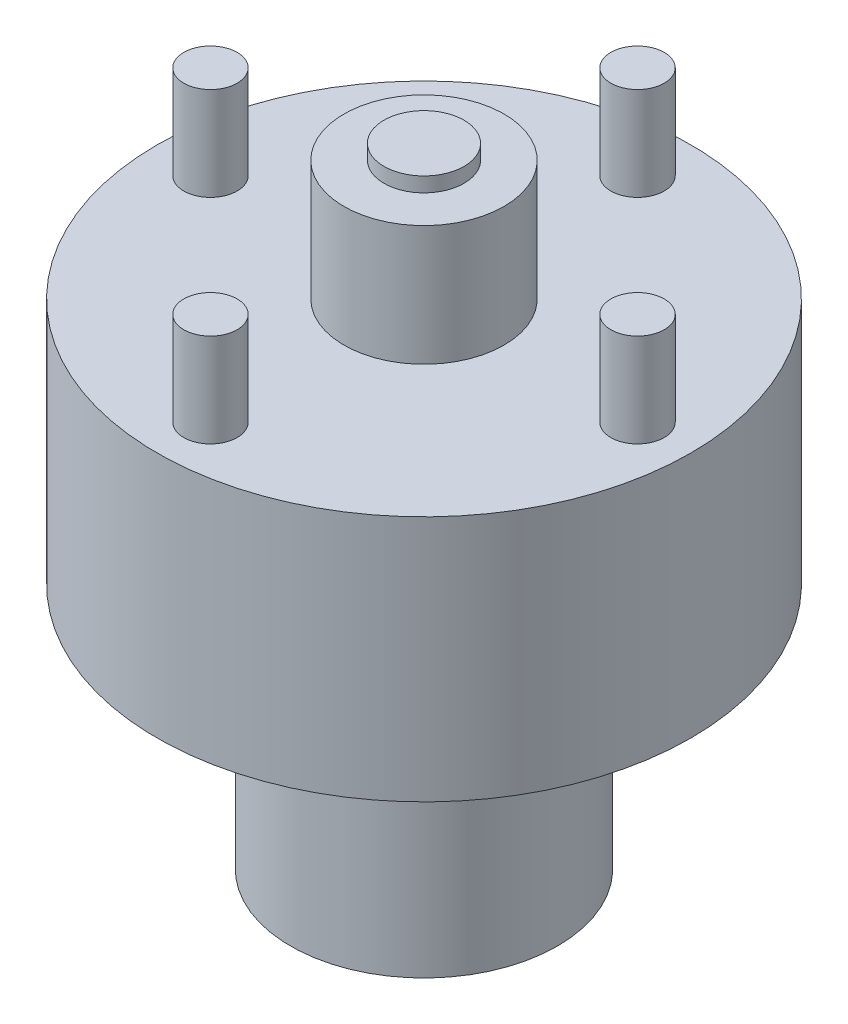
ISO-10303-21;
HEADER;
FILE_DESCRIPTION(('STEP AP214'),'2;1');
FILE_NAME('part.step','',(''),(''),'','','');
FILE_SCHEMA(('AUTOMOTIVE_DESIGN { 1 0 10303 214 1 1 1 1 }'));
ENDSEC;
DATA;
#1=APPLICATION_CONTEXT('core data for automotive mechanical design processes');
#2=APPLICATION_PROTOCOL_DEFINITION('international standard','automotive_design',2000,#1);
#3=PRODUCT_CONTEXT('',#1,'mechanical');
#4=PRODUCT('Part','Part','',(#3));
#5=PRODUCT_RELATED_PRODUCT_CATEGORY('part','',(#4));
#6=PRODUCT_DEFINITION_FORMATION('','',#4);
#7=PRODUCT_DEFINITION_CONTEXT('part definition',#1,'design');
#8=PRODUCT_DEFINITION('design','',#6,#7);
#9=PRODUCT_DEFINITION_SHAPE('','',#8);
#10=(LENGTH_UNIT() NAMED_UNIT(*) SI_UNIT(.MILLI.,.METRE.));
#11=(NAMED_UNIT(*) PLANE_ANGLE_UNIT() SI_UNIT($,.RADIAN.));
#12=(NAMED_UNIT(*) SI_UNIT($,.STERADIAN.) SOLID_ANGLE_UNIT());
#13=UNCERTAINTY_MEASURE_WITH_UNIT(LENGTH_MEASURE(1.E-05),#10,'distance_accuracy_value','');
#14=(GEOMETRIC_REPRESENTATION_CONTEXT(3) GLOBAL_UNCERTAINTY_ASSIGNED_CONTEXT((#13)) GLOBAL_UNIT_ASSIGNED_CONTEXT((#10,
#11,#12)) REPRESENTATION_CONTEXT('',''));
#15=CARTESIAN_POINT('',(0.,0.,0.));
#16=DIRECTION('',(0.,0.,1.));
#17=DIRECTION('',(1.,0.,0.));
#18=AXIS2_PLACEMENT_3D('',#15,#16,#17);
#19=CARTESIAN_POINT('',(0.,14.375,0.));
#20=DIRECTION('',(0.,1.,0.));
#21=DIRECTION('',(-1.,0.,0.));
#22=AXIS2_PLACEMENT_3D('',#19,#20,#21);
#23=PLANE('',#22);
#24=CARTESIAN_POINT('',(0.,14.375,0.));
#25=DIRECTION('',(0.,-1.,0.));
#26=DIRECTION('',(1.,0.,0.));
#27=AXIS2_PLACEMENT_3D('',#24,#25,#26);
#28=CIRCLE('',#27,1.5);
#29=CARTESIAN_POINT('',(1.5,14.375,0.));
#30=VERTEX_POINT('',#29);
#31=EDGE_CURVE('E10',#30,#30,#28,.T.);
#32=ORIENTED_EDGE('',*,*,#31,.F.);
#33=EDGE_LOOP('',(#32));
#34=FACE_BOUND('',#33,.T.);
#35=ADVANCED_FACE('F14',(#34),#23,.T.);
#36=CARTESIAN_POINT('',(0.,-4.325,0.));
#37=DIRECTION('',(0.,-1.,0.));
#38=DIRECTION('',(1.,0.,0.));
#39=AXIS2_PLACEMENT_3D('',#36,#37,#38);
#40=CYLINDRICAL_SURFACE('',#39,1.5);
#41=ORIENTED_EDGE('',*,*,#31,.T.);
#42=EDGE_LOOP('',(#41));
#43=FACE_BOUND('',#42,.T.);
#44=CARTESIAN_POINT('',(0.,13.825,0.));
#45=DIRECTION('',(0.,-1.,0.));
#46=DIRECTION('',(1.,0.,0.));
#47=AXIS2_PLACEMENT_3D('',#44,#45,#46);
#48=CIRCLE('',#47,1.5);
#49=CARTESIAN_POINT('',(1.5,13.825,0.));
#50=VERTEX_POINT('',#49);
#51=EDGE_CURVE('E25',#50,#50,#48,.T.);
#52=ORIENTED_EDGE('',*,*,#51,.F.);
#53=EDGE_LOOP('',(#52));
#54=FACE_BOUND('',#53,.T.);
#55=ADVANCED_FACE('F94',(#43,#54),#40,.T.);
#56=CARTESIAN_POINT('',(1.5,13.825,0.));
#57=DIRECTION('',(0.,1.,0.));
#58=DIRECTION('',(-1.,0.,0.));
#59=AXIS2_PLACEMENT_3D('',#56,#57,#58);
#60=PLANE('',#59);
#61=ORIENTED_EDGE('',*,*,#51,.T.);
#62=EDGE_LOOP('',(#61));
#63=FACE_BOUND('',#62,.T.);
#64=CARTESIAN_POINT('',(0.,13.825,0.));
#65=DIRECTION('',(0.,-1.,0.));
#66=DIRECTION('',(1.,0.,0.));
#67=AXIS2_PLACEMENT_3D('',#64,#65,#66);
#68=CIRCLE('',#67,3.);
#69=CARTESIAN_POINT('',(3.,13.825,0.));
#70=VERTEX_POINT('',#69);
#71=EDGE_CURVE('E29',#70,#70,#68,.T.);
#72=ORIENTED_EDGE('',*,*,#71,.F.);
#73=EDGE_LOOP('',(#72));
#74=FACE_BOUND('',#73,.T.);
#75=ADVANCED_FACE('F99',(#63,#74),#60,.T.);
#76=CARTESIAN_POINT('',(0.,-4.325,0.));
#77=DIRECTION('',(0.,-1.,0.));
#78=DIRECTION('',(1.,0.,0.));
#79=AXIS2_PLACEMENT_3D('',#76,#77,#78);
#80=CYLINDRICAL_SURFACE('',#79,3.);
#81=ORIENTED_EDGE('',*,*,#71,.T.);
#82=EDGE_LOOP('',(#81));
#83=FACE_BOUND('',#82,.T.);
#84=CARTESIAN_POINT('',(0.,9.325,0.));
#85=DIRECTION('',(0.,-1.,0.));
#86=DIRECTION('',(1.,0.,0.));
#87=AXIS2_PLACEMENT_3D('',#84,#85,#86);
#88=CIRCLE('',#87,3.);
#89=CARTESIAN_POINT('',(3.,9.325,0.));
#90=VERTEX_POINT('',#89);
#91=EDGE_CURVE('E34',#90,#90,#88,.T.);
#92=ORIENTED_EDGE('',*,*,#91,.F.);
#93=EDGE_LOOP('',(#92));
#94=FACE_BOUND('',#93,.T.);
#95=ADVANCED_FACE('F103',(#83,#94),#80,.T.);
#96=CARTESIAN_POINT('',(10.,9.325,0.));
#97=DIRECTION('',(0.,1.,0.));
#98=DIRECTION('',(-1.,0.,0.));
#99=AXIS2_PLACEMENT_3D('',#96,#97,#98);
#100=PLANE('',#99);
#101=CARTESIAN_POINT('',(8.,9.325,1.5144976769533E-13));
#102=DIRECTION('',(0.,1.,0.));
#103=DIRECTION('',(-1.,0.,0.));
#104=AXIS2_PLACEMENT_3D('',#101,#102,#103);
#105=CIRCLE('',#104,1.);
#106=CARTESIAN_POINT('',(7.,9.325,1.5144976769533E-13));
#107=VERTEX_POINT('',#106);
#108=EDGE_CURVE('E251',#107,#107,#105,.T.);
#109=ORIENTED_EDGE('',*,*,#108,.F.);
#110=EDGE_LOOP('',(#109));
#111=FACE_BOUND('',#110,.T.);
#112=CARTESIAN_POINT('',(1.21957625001815E-13,9.325,-8.));
#113=DIRECTION('',(0.,1.,0.));
#114=DIRECTION('',(-1.,0.,0.));
#115=AXIS2_PLACEMENT_3D('',#112,#113,#114);
#116=CIRCLE('',#115,1.);
#117=CARTESIAN_POINT('',(-0.999999999999878,9.325,-8.));
#118=VERTEX_POINT('',#117);
#119=EDGE_CURVE('E250',#118,#118,#116,.T.);
#120=ORIENTED_EDGE('',*,*,#119,.F.);
#121=EDGE_LOOP('',(#120));
#122=FACE_BOUND('',#121,.T.);
#123=CARTESIAN_POINT('',(-8.,9.325,0.));
#124=DIRECTION('',(0.,1.,0.));
#125=DIRECTION('',(-1.,0.,0.));
#126=AXIS2_PLACEMENT_3D('',#123,#124,#125);
#127=CIRCLE('',#126,1.);
#128=CARTESIAN_POINT('',(-9.,9.325,0.));
#129=VERTEX_POINT('',#128);
#130=EDGE_CURVE('E260',#129,#129,#127,.T.);
#131=ORIENTED_EDGE('',*,*,#130,.F.);
#132=EDGE_LOOP('',(#131));
#133=FACE_BOUND('',#132,.T.);
#134=CARTESIAN_POINT('',(0.,9.325,8.));
#135=DIRECTION('',(0.,1.,0.));
#136=DIRECTION('',(-1.,0.,0.));
#137=AXIS2_PLACEMENT_3D('',#134,#135,#136);
#138=CIRCLE('',#137,1.);
#139=CARTESIAN_POINT('',(-1.00000000000007,9.325,8.));
#140=VERTEX_POINT('',#139);
#141=EDGE_CURVE('E61',#140,#140,#138,.T.);
#142=ORIENTED_EDGE('',*,*,#141,.F.);
#143=EDGE_LOOP('',(#142));
#144=FACE_BOUND('',#143,.T.);
#145=ORIENTED_EDGE('',*,*,#91,.T.);
#146=EDGE_LOOP('',(#145));
#147=FACE_BOUND('',#146,.T.);
#148=CARTESIAN_POINT('',(0.,9.325,0.));
#149=DIRECTION('',(0.,-1.,0.));
#150=DIRECTION('',(1.,0.,0.));
#151=AXIS2_PLACEMENT_3D('',#148,#149,#150);
#152=CIRCLE('',#151,10.);
#153=CARTESIAN_POINT('',(10.,9.325,0.));
#154=VERTEX_POINT('',#153);
#155=EDGE_CURVE('E37',#154,#154,#152,.T.);
#156=ORIENTED_EDGE('',*,*,#155,.F.);
#157=EDGE_LOOP('',(#156));
#158=FACE_BOUND('',#157,.T.);
#159=ADVANCED_FACE('F110',(#111,#122,#133,#144,#147,#158),#100,.T.);
#160=CARTESIAN_POINT('',(0.,-4.325,0.));
#161=DIRECTION('',(0.,-1.,0.));
#162=DIRECTION('',(1.,0.,0.));
#163=AXIS2_PLACEMENT_3D('',#160,#161,#162);
#164=CYLINDRICAL_SURFACE('',#163,10.);
#165=ORIENTED_EDGE('',*,*,#155,.T.);
#166=EDGE_LOOP('',(#165));
#167=FACE_BOUND('',#166,.T.);
#168=CARTESIAN_POINT('',(0.,0.0749999999999987,0.));
#169=DIRECTION('',(0.,-1.,0.));
#170=DIRECTION('',(1.,0.,0.));
#171=AXIS2_PLACEMENT_3D('',#168,#169,#170);
#172=CIRCLE('',#171,10.);
#173=CARTESIAN_POINT('',(10.,0.0750000000000004,0.));
#174=VERTEX_POINT('',#173);
#175=EDGE_CURVE('E40',#174,#174,#172,.T.);
#176=ORIENTED_EDGE('',*,*,#175,.F.);
#177=EDGE_LOOP('',(#176));
#178=FACE_BOUND('',#177,.T.);
#179=ADVANCED_FACE('F114',(#167,#178),#164,.T.);
#180=CARTESIAN_POINT('',(5.,0.075,0.));
#181=DIRECTION('',(0.,-1.,0.));
#182=DIRECTION('',(1.,0.,0.));
#183=AXIS2_PLACEMENT_3D('',#180,#181,#182);
#184=PLANE('',#183);
#185=ORIENTED_EDGE('',*,*,#175,.T.);
#186=EDGE_LOOP('',(#185));
#187=FACE_BOUND('',#186,.T.);
#188=CARTESIAN_POINT('',(0.,0.075,0.));
#189=DIRECTION('',(0.,-1.,0.));
#190=DIRECTION('',(1.,0.,0.));
#191=AXIS2_PLACEMENT_3D('',#188,#189,#190);
#192=CIRCLE('',#191,5.);
#193=CARTESIAN_POINT('',(5.,0.0750000000000008,0.));
#194=VERTEX_POINT('',#193);
#195=EDGE_CURVE('E43',#194,#194,#192,.T.);
#196=ORIENTED_EDGE('',*,*,#195,.F.);
#197=EDGE_LOOP('',(#196));
#198=FACE_BOUND('',#197,.T.);
#199=ADVANCED_FACE('F90',(#187,#198),#184,.T.);
#200=CARTESIAN_POINT('',(0.,-4.325,0.));
#201=DIRECTION('',(0.,-1.,0.));
#202=DIRECTION('',(1.,0.,0.));
#203=AXIS2_PLACEMENT_3D('',#200,#201,#202);
#204=CYLINDRICAL_SURFACE('',#203,5.);
#205=CARTESIAN_POINT('',(-4.89897948556636,-6.75,-1.));
#206=CARTESIAN_POINT('',(-4.89898059043933,-6.80556437548198,-0.999997945876045));
#207=CARTESIAN_POINT('',(-4.89993508346913,-6.86115462330649,-0.995353171723656));
#208=CARTESIAN_POINT('',(-4.90364431385263,-6.97076250511841,-0.976912283588335));
#209=CARTESIAN_POINT('',(-4.90640049166332,-7.02477884463107,-0.963108847071181));
#210=CARTESIAN_POINT('',(-4.91338873700355,-7.12963730336293,-0.926795782617738));
#211=CARTESIAN_POINT('',(-4.91761933615312,-7.18048252153493,-0.904294814152084));
#212=CARTESIAN_POINT('',(-4.92707799486421,-7.27767484469461,-0.851249107671044));
#213=CARTESIAN_POINT('',(-4.93230599875014,-7.32402220053727,-0.820704818601296));
#214=CARTESIAN_POINT('',(-4.9432529969268,-7.4115610038545,-0.75197907565329));
#215=CARTESIAN_POINT('',(-4.94897737836825,-7.45267958788414,-0.713705655913281));
#216=CARTESIAN_POINT('',(-4.9602247230302,-7.52795753357881,-0.630806789021351));
#217=CARTESIAN_POINT('',(-4.96574767210945,-7.56211640741714,-0.586180896977995));
#218=CARTESIAN_POINT('',(-4.97602796417447,-7.6227880176285,-0.491361355924245));
#219=CARTESIAN_POINT('',(-4.9807782144152,-7.64923151381665,-0.441122567672208));
#220=CARTESIAN_POINT('',(-4.98891736883662,-7.69327493704813,-0.336804150387275));
#221=CARTESIAN_POINT('',(-4.99230640044128,-7.71087569190099,-0.282724881420554));
#222=CARTESIAN_POINT('',(-4.99730320688411,-7.73650719361963,-0.173016773278494));
#223=CARTESIAN_POINT('',(-4.99893386288125,-7.74466097757101,-0.117417739214814));
#224=CARTESIAN_POINT('',(-5.00030921183606,-7.75155095183831,-0.00561856843753665));
#225=CARTESIAN_POINT('',(-5.00005408652759,-7.75028804964582,0.0505815098318431));
#226=CARTESIAN_POINT('',(-4.99770434868515,-7.73847381978444,0.161142000743589));
#227=CARTESIAN_POINT('',(-4.99563598365838,-7.72805502283215,0.21551721429847));
#228=CARTESIAN_POINT('',(-4.98992177159409,-7.69843496754111,0.321731626580302));
#229=CARTESIAN_POINT('',(-4.98627586144039,-7.67923335780813,0.37357072374713));
#230=CARTESIAN_POINT('',(-4.97777296019959,-7.63246995985273,0.473619463200887));
#231=CARTESIAN_POINT('',(-4.97290848175224,-7.60485624889511,0.521804174133899));
#232=CARTESIAN_POINT('',(-4.96250469473785,-7.5420909227634,0.612905045859755));
#233=CARTESIAN_POINT('',(-4.95696530855222,-7.50693844022948,0.655820599525));
#234=CARTESIAN_POINT('',(-4.9457096436446,-7.42936637789153,0.735951431053457));
#235=CARTESIAN_POINT('',(-4.93999196457516,-7.38683081327041,0.773054316573631));
#236=CARTESIAN_POINT('',(-4.92911571598761,-7.29608355754925,0.839618493176807));
#237=CARTESIAN_POINT('',(-4.92395715704548,-7.2478717591168,0.869079639727751));
#238=CARTESIAN_POINT('',(-4.91478047472924,-7.1469791681782,0.919562814801881));
#239=CARTESIAN_POINT('',(-4.91076481563549,-7.09428903236034,0.940566647777709));
#240=CARTESIAN_POINT('',(-4.90436476321273,-6.98602867627601,0.973390341627581));
#241=CARTESIAN_POINT('',(-4.90198015728428,-6.93045883238092,0.985211399456641));
#242=CARTESIAN_POINT('',(-4.89915479267828,-6.81903514200096,0.999166006036051));
#243=CARTESIAN_POINT('',(-4.89868147057154,-6.76320242568966,1.00146185889791));
#244=CARTESIAN_POINT('',(-4.89964485688854,-6.65195177680032,0.996737628310738));
#245=CARTESIAN_POINT('',(-4.90108145700388,-6.59653382088114,0.989718073122442));
#246=CARTESIAN_POINT('',(-4.90567232494915,-6.48823135970776,0.966702208074156));
#247=CARTESIAN_POINT('',(-4.90880999014497,-6.43532765696424,0.950792620839297));
#248=CARTESIAN_POINT('',(-4.91643489351665,-6.33293672097126,0.910541035308517));
#249=CARTESIAN_POINT('',(-4.92092224286269,-6.28344976956428,0.886198342373176));
#250=CARTESIAN_POINT('',(-4.93081405962039,-6.18858689004984,0.829404142215597));
#251=CARTESIAN_POINT('',(-4.93622971864903,-6.14327295369917,0.796851077982752));
#252=CARTESIAN_POINT('',(-4.94733723826636,-6.05869168799908,0.724695572212711));
#253=CARTESIAN_POINT('',(-4.95302912723818,-6.01942498175074,0.685092405144536));
#254=CARTESIAN_POINT('',(-4.96415345869215,-5.94743744081442,0.59923227349789));
#255=CARTESIAN_POINT('',(-4.96958057708684,-5.91482634535,0.55288249892963));
#256=CARTESIAN_POINT('',(-4.9794712762862,-5.85785411850042,0.455267896634755));
#257=CARTESIAN_POINT('',(-4.98393489755211,-5.83349264065522,0.404003275433506));
#258=CARTESIAN_POINT('',(-4.99137294061067,-5.79387112825337,0.298302680824011));
#259=CARTESIAN_POINT('',(-4.99435579142604,-5.77855948177375,0.243886673478076));
#260=CARTESIAN_POINT('',(-4.9985323593766,-5.75730875233615,0.13318945467991));
#261=CARTESIAN_POINT('',(-4.99972629199843,-5.75136854052431,0.0769084687112125));
#262=CARTESIAN_POINT('',(-5.00018540454121,-5.74907301903711,-0.0348728939036245));
#263=CARTESIAN_POINT('',(-4.99948378549351,-5.75255271954379,-0.0903698121415032));
#264=CARTESIAN_POINT('',(-4.99630043560318,-5.76863395054781,-0.199971031315642));
#265=CARTESIAN_POINT('',(-4.99381872714351,-5.78123536634807,-0.254075349753692));
#266=CARTESIAN_POINT('',(-4.98735498365,-5.81512899209164,-0.359252749745098));
#267=CARTESIAN_POINT('',(-4.98337637247912,-5.83640137813118,-0.410332443240283));
#268=CARTESIAN_POINT('',(-4.97434722123382,-5.8870122413309,-0.508221220185954));
#269=CARTESIAN_POINT('',(-4.96929659645878,-5.91635135590372,-0.555029965767412));
#270=CARTESIAN_POINT('',(-4.95857599157868,-5.98281938706208,-0.643863890106359));
#271=CARTESIAN_POINT('',(-4.95289733422142,-6.02006633638677,-0.685799716116506));
#272=CARTESIAN_POINT('',(-4.94161222903622,-6.10105024009578,-0.762882617756848));
#273=CARTESIAN_POINT('',(-4.93600579862875,-6.14478872946874,-0.798028083202714));
#274=CARTESIAN_POINT('',(-4.92543342749964,-6.23807931670018,-0.860892219455201));
#275=CARTESIAN_POINT('',(-4.92047503631328,-6.28768896116037,-0.888526814639769));
#276=CARTESIAN_POINT('',(-4.91185237184445,-6.3909327732997,-0.93502404928781));
#277=CARTESIAN_POINT('',(-4.90818692536957,-6.44456323869792,-0.953894645979291));
#278=CARTESIAN_POINT('',(-4.90329681128922,-6.54026245543657,-0.978669139854273));
#279=CARTESIAN_POINT('',(-4.90168784915661,-6.58178541951146,-0.986653898522986));
#280=CARTESIAN_POINT('',(-4.8995287845803,-6.66553395455364,-0.99732001796041));
#281=CARTESIAN_POINT('',(-4.89897864563277,-6.70775950124817,-1.00000156156205));
#282=CARTESIAN_POINT('',(-4.89897948556636,-6.75,-1.));
#283=B_SPLINE_CURVE_WITH_KNOTS('',3,(#205,#206,#207,#208,#209,#210,#211,#212,#213,#214,#215,
#216,#217,#218,#219,#220,#221,#222,#223,#224,#225,#226,#227,#228,#229,#230,#231,#232,#233,#234,
#235,#236,#237,#238,#239,#240,#241,#242,#243,#244,#245,#246,#247,#248,#249,#250,#251,#252,#253,
#254,#255,#256,#257,#258,#259,#260,#261,#262,#263,#264,#265,#266,#267,#268,#269,#270,#271,#272,
#273,#274,#275,#276,#277,#278,#279,#280,#281,#282),.UNSPECIFIED.,.T.,.F.,(4,2,2,2,2,2,2,2,2,2,2,
2,2,2,2,2,2,2,2,2,2,2,2,2,2,2,2,2,2,2,2,2,2,2,2,2,2,2,4),(0.,0.166538463856524,
0.333210239259265,0.499716497915551,0.666213464834828,0.834822525459333,1.00344340032919,
1.17353400434947,1.34360868244057,1.51144248880577,1.67926012113745,1.84468789631034,
2.01012229071247,2.176599242198,2.34309535767563,2.5124934675998,2.68189478120217,
2.85165863170273,3.02140035013521,3.1882375780209,3.35506534525918,3.52029341780816,
3.68553510351896,3.85293059772018,4.02034332867706,4.19032601730947,4.36030156627602,
4.52929813576147,4.69827434689125,4.86431017412183,5.03034391364254,5.19600017072949,
5.36166952132181,5.53001152023094,5.69839338887278,5.86858898576538,6.0386297508643,
6.16523803634393,6.29184195681711),.UNSPECIFIED.);
#284=CARTESIAN_POINT('',(-4.89897948556636,-6.75,-1.));
#285=VERTEX_POINT('',#284);
#286=EDGE_CURVE('E55',#285,#285,#283,.T.);
#287=ORIENTED_EDGE('',*,*,#286,.F.);
#288=EDGE_LOOP('',(#287));
#289=FACE_BOUND('',#288,.T.);
#290=ORIENTED_EDGE('',*,*,#195,.T.);
#291=EDGE_LOOP('',(#290));
#292=FACE_BOUND('',#291,.T.);
#293=CARTESIAN_POINT('',(0.,-9.175,0.));
#294=DIRECTION('',(0.,-1.,0.));
#295=DIRECTION('',(1.,0.,0.));
#296=AXIS2_PLACEMENT_3D('',#293,#294,#295);
#297=CIRCLE('',#296,5.);
#298=CARTESIAN_POINT('',(5.,-9.175,0.));
#299=VERTEX_POINT('',#298);
#300=EDGE_CURVE('E46',#299,#299,#297,.T.);
#301=ORIENTED_EDGE('',*,*,#300,.F.);
#302=EDGE_LOOP('',(#301));
#303=FACE_BOUND('',#302,.T.);
#304=ADVANCED_FACE('F63',(#289,#292,#303),#204,.T.);
#305=CARTESIAN_POINT('',(2.85,-9.175,0.));
#306=DIRECTION('',(0.,-1.,0.));
#307=DIRECTION('',(1.,0.,0.));
#308=AXIS2_PLACEMENT_3D('',#305,#306,#307);
#309=PLANE('',#308);
#310=ORIENTED_EDGE('',*,*,#300,.T.);
#311=EDGE_LOOP('',(#310));
#312=FACE_BOUND('',#311,.T.);
#313=CARTESIAN_POINT('',(0.,-9.175,0.));
#314=DIRECTION('',(0.,-1.,0.));
#315=DIRECTION('',(1.,0.,0.));
#316=AXIS2_PLACEMENT_3D('',#313,#314,#315);
#317=CIRCLE('',#316,2.85);
#318=CARTESIAN_POINT('',(2.85,-9.175,0.));
#319=VERTEX_POINT('',#318);
#320=EDGE_CURVE('E49',#319,#319,#317,.T.);
#321=ORIENTED_EDGE('',*,*,#320,.F.);
#322=EDGE_LOOP('',(#321));
#323=FACE_BOUND('',#322,.T.);
#324=ADVANCED_FACE('F82',(#312,#323),#309,.T.);
#325=CARTESIAN_POINT('',(0.,-4.325,0.));
#326=DIRECTION('',(0.,-1.,0.));
#327=DIRECTION('',(1.,0.,0.));
#328=AXIS2_PLACEMENT_3D('',#325,#326,#327);
#329=CYLINDRICAL_SURFACE('',#328,2.85);
#330=CARTESIAN_POINT('',(-2.66880122901651,-6.75,-1.));
#331=CARTESIAN_POINT('',(-2.6688004561792,-6.6957195715336,-1.0000009088373));
#332=CARTESIAN_POINT('',(-2.67047529533561,-6.64144547181646,-0.995565595803335));
#333=CARTESIAN_POINT('',(-2.6769540281088,-6.53451694904152,-0.978009750469148));
#334=CARTESIAN_POINT('',(-2.68175816860933,-6.48186265412019,-0.964888532900042));
#335=CARTESIAN_POINT('',(-2.69388577441423,-6.37974264644938,-0.930488003285745));
#336=CARTESIAN_POINT('',(-2.70120386046258,-6.3302703910639,-0.909226099368961));
#337=CARTESIAN_POINT('',(-2.71752663239187,-6.23557750375952,-0.859208192677543));
#338=CARTESIAN_POINT('',(-2.72653174981666,-6.19035796414372,-0.830450271677981));
#339=CARTESIAN_POINT('',(-2.74565220206296,-6.10349109822925,-0.764919380662244));
#340=CARTESIAN_POINT('',(-2.75579731605631,-6.06205499571135,-0.727875033606545));
#341=CARTESIAN_POINT('',(-2.77580433788903,-5.98583727451353,-0.647400626530004));
#342=CARTESIAN_POINT('',(-2.78566619422497,-5.95105685957762,-0.603969413891318));
#343=CARTESIAN_POINT('',(-2.80434404816319,-5.88815556112437,-0.510385631744187));
#344=CARTESIAN_POINT('',(-2.81312099064914,-5.86025936669437,-0.460073552891832));
#345=CARTESIAN_POINT('',(-2.82828636345265,-5.81341182048635,-0.355109291057522));
#346=CARTESIAN_POINT('',(-2.83467551181298,-5.79445777922845,-0.300458418814162));
#347=CARTESIAN_POINT('',(-2.84413430705331,-5.76675879210415,-0.190585056556345));
#348=CARTESIAN_POINT('',(-2.8473215150007,-5.75765127156761,-0.135464284268941));
#349=CARTESIAN_POINT('',(-2.85043649550697,-5.74874737773224,-0.0243908239584998));
#350=CARTESIAN_POINT('',(-2.85036519708511,-5.74894835052763,0.0315616224015104));
#351=CARTESIAN_POINT('',(-2.84704888494739,-5.75843341298816,0.140130655832481));
#352=CARTESIAN_POINT('',(-2.84394173969892,-5.76732293135015,0.192786631831926));
#353=CARTESIAN_POINT('',(-2.83507910339868,-5.79327568266814,0.295805492712652));
#354=CARTESIAN_POINT('',(-2.82932342862927,-5.81033948264387,0.346168218254199));
#355=CARTESIAN_POINT('',(-2.81564310780338,-5.8523670644065,0.443992098179209));
#356=CARTESIAN_POINT('',(-2.80768960652686,-5.87743668848086,0.491403578107379));
#357=CARTESIAN_POINT('',(-2.79043223607277,-5.93467464112633,0.581457940211361));
#358=CARTESIAN_POINT('',(-2.7811279647844,-5.96684508503011,0.624099395682192));
#359=CARTESIAN_POINT('',(-2.7615721871171,-6.03932497584303,0.705742571770237));
#360=CARTESIAN_POINT('',(-2.7512965796386,-6.07996972656193,0.744441295827144));
#361=CARTESIAN_POINT('',(-2.73135409710691,-6.16724998858519,0.814578126149172));
#362=CARTESIAN_POINT('',(-2.72168733842612,-6.21388664000509,0.846014847435269));
#363=CARTESIAN_POINT('',(-2.70391670225723,-6.31288176839945,0.901217580263694));
#364=CARTESIAN_POINT('',(-2.69584274091759,-6.36532524289232,0.924841548429458));
#365=CARTESIAN_POINT('',(-2.68251690935625,-6.47380221034754,0.962815062382638));
#366=CARTESIAN_POINT('',(-2.67726370141958,-6.52983398745576,0.977169005045741));
#367=CARTESIAN_POINT('',(-2.67048203571561,-6.64093606300953,0.995548843444258));
#368=CARTESIAN_POINT('',(-2.66878256966579,-6.69591736983434,1.00004943047604));
#369=CARTESIAN_POINT('',(-2.66882018555498,-6.80586404307055,0.999949776312317));
#370=CARTESIAN_POINT('',(-2.67055655347963,-6.86082941042028,0.995351426003273));
#371=CARTESIAN_POINT('',(-2.67709835294654,-6.96691601797957,0.977612700439236));
#372=CARTESIAN_POINT('',(-2.68177988166501,-7.01810334682837,0.964816814318967));
#373=CARTESIAN_POINT('',(-2.69354382706731,-7.11758916654746,0.931467718376879));
#374=CARTESIAN_POINT('',(-2.70062669740521,-7.16588710953409,0.91091304270516));
#375=CARTESIAN_POINT('',(-2.71669459662099,-7.26005708546383,0.861833575393774));
#376=CARTESIAN_POINT('',(-2.72573641769984,-7.30578956896414,0.833060141845878));
#377=CARTESIAN_POINT('',(-2.74459943317989,-7.39194759906375,0.768634484936977));
#378=CARTESIAN_POINT('',(-2.75442088011829,-7.43237141472647,0.732980027271063));
#379=CARTESIAN_POINT('',(-2.77438046801183,-7.50903358625576,0.653511944888941));
#380=CARTESIAN_POINT('',(-2.7845069051104,-7.54492614721994,0.60936073688974));
#381=CARTESIAN_POINT('',(-2.80341637092162,-7.6088230897007,0.51541188966285));
#382=CARTESIAN_POINT('',(-2.81219942982493,-7.63682764850163,0.465614377372212));
#383=CARTESIAN_POINT('',(-2.82740339743662,-7.68391946329594,0.361960436343255));
#384=CARTESIAN_POINT('',(-2.83383726161722,-7.70305578886157,0.308128305035709));
#385=CARTESIAN_POINT('',(-2.84367108199614,-7.73191216670186,0.197736314625076));
#386=CARTESIAN_POINT('',(-2.84707226607693,-7.74163603006485,0.141177569269197));
#387=CARTESIAN_POINT('',(-2.85035502229535,-7.75101995667176,0.0300845842132699));
#388=CARTESIAN_POINT('',(-2.85040939729414,-7.75117412716316,-0.0244032316871605));
#389=CARTESIAN_POINT('',(-2.8474281140692,-7.74265442761021,-0.132592609972267));
#390=CARTESIAN_POINT('',(-2.84439275373857,-7.73398140862874,-0.186294247649049));
#391=CARTESIAN_POINT('',(-2.83564322909889,-7.70839056721116,-0.290352498452024));
#392=CARTESIAN_POINT('',(-2.82998153536733,-7.69163399239515,-0.340753502067569));
#393=CARTESIAN_POINT('',(-2.81656401936877,-7.65050517199252,-0.438042555692486));
#394=CARTESIAN_POINT('',(-2.80880780739049,-7.62613150901861,-0.48492994987479));
#395=CARTESIAN_POINT('',(-2.79161197017162,-7.56936330613099,-0.575872393051686));
#396=CARTESIAN_POINT('',(-2.78211818998541,-7.53669132596236,-0.619743858208922));
#397=CARTESIAN_POINT('',(-2.76262794495338,-7.46471125159769,-0.701539722736158));
#398=CARTESIAN_POINT('',(-2.75263131202982,-7.42540092805744,-0.739462115958666));
#399=CARTESIAN_POINT('',(-2.73272441983475,-7.33916641684199,-0.810013679639654));
#400=CARTESIAN_POINT('',(-2.7228379392885,-7.29198067097468,-0.842330970110305));
#401=CARTESIAN_POINT('',(-2.70480170290923,-7.19253549775383,-0.898567623674657));
#402=CARTESIAN_POINT('',(-2.69665173524843,-7.14027669036888,-0.922488011291749));
#403=CARTESIAN_POINT('',(-2.68319573762921,-7.03259712792493,-0.9609240878375));
#404=CARTESIAN_POINT('',(-2.67786414119202,-6.97721002696421,-0.9755245817351));
#405=CARTESIAN_POINT('',(-2.67066808381094,-6.86454568729343,-0.995059858128937));
#406=CARTESIAN_POINT('',(-2.66880204440925,-6.8072693211919,-0.999999041118564));
#407=CARTESIAN_POINT('',(-2.66880122901651,-6.75,-1.));
#408=B_SPLINE_CURVE_WITH_KNOTS('',3,(#330,#331,#332,#333,#334,#335,#336,#337,#338,#339,#340,
#341,#342,#343,#344,#345,#346,#347,#348,#349,#350,#351,#352,#353,#354,#355,#356,#357,#358,#359,
#360,#361,#362,#363,#364,#365,#366,#367,#368,#369,#370,#371,#372,#373,#374,#375,#376,#377,#378,
#379,#380,#381,#382,#383,#384,#385,#386,#387,#388,#389,#390,#391,#392,#393,#394,#395,#396,#397,
#398,#399,#400,#401,#402,#403,#404,#405,#406,#407),.UNSPECIFIED.,.T.,.F.,(4,2,2,2,2,2,2,2,2,2,2,
2,2,2,2,2,2,2,2,2,2,2,2,2,2,2,2,2,2,2,2,2,2,2,2,2,2,2,4),(0.,0.162628723538886,
0.325270279096272,0.487565965379972,0.649903223845956,0.818642974618485,0.987413214786567,
1.16112272087991,1.33477994800647,1.50179859816922,1.66876963063309,1.82849438656856,
1.98823022362496,2.15017196700624,2.31216201806398,2.4825439787521,2.65295840720246,
2.82631967049563,2.99959864611489,3.16432708021973,3.32902128504687,3.48721183361133,
3.64543228371552,3.8090664165867,3.97275377199375,4.1453166569414,4.31787566319584,
4.48946812040895,4.66099107105911,4.82365007974097,4.98629340733533,5.14581872013117,
5.30537373508047,5.47119572562199,5.63707351504663,5.81035649891892,5.98361833282314,
6.15528023611822,6.32686393334608),.UNSPECIFIED.);
#409=CARTESIAN_POINT('',(-2.66880122901651,-6.75,-1.));
#410=VERTEX_POINT('',#409);
#411=EDGE_CURVE('E17',#410,#410,#408,.T.);
#412=ORIENTED_EDGE('',*,*,#411,.F.);
#413=EDGE_LOOP('',(#412));
#414=FACE_BOUND('',#413,.T.);
#415=ORIENTED_EDGE('',*,*,#320,.T.);
#416=EDGE_LOOP('',(#415));
#417=FACE_BOUND('',#416,.T.);
#418=CARTESIAN_POINT('',(0.,-4.325,0.));
#419=DIRECTION('',(0.,-1.,0.));
#420=DIRECTION('',(1.,0.,0.));
#421=AXIS2_PLACEMENT_3D('',#418,#419,#420);
#422=CIRCLE('',#421,2.85);
#423=CARTESIAN_POINT('',(2.85,-4.325,0.));
#424=VERTEX_POINT('',#423);
#425=EDGE_CURVE('E52',#424,#424,#422,.T.);
#426=ORIENTED_EDGE('',*,*,#425,.F.);
#427=EDGE_LOOP('',(#426));
#428=FACE_BOUND('',#427,.T.);
#429=ADVANCED_FACE('F78',(#414,#417,#428),#329,.F.);
#430=CARTESIAN_POINT('',(2.85,-4.325,0.));
#431=DIRECTION('',(0.,-1.,0.));
#432=DIRECTION('',(1.,0.,0.));
#433=AXIS2_PLACEMENT_3D('',#430,#431,#432);
#434=PLANE('',#433);
#435=ORIENTED_EDGE('',*,*,#425,.T.);
#436=EDGE_LOOP('',(#435));
#437=FACE_BOUND('',#436,.T.);
#438=ADVANCED_FACE('F73',(#437),#434,.T.);
#439=CARTESIAN_POINT('',(-11.,-6.75,0.));
#440=DIRECTION('',(1.,0.,0.));
#441=DIRECTION('',(0.,0.,-1.));
#442=AXIS2_PLACEMENT_3D('',#439,#440,#441);
#443=CYLINDRICAL_SURFACE('',#442,1.);
#444=ORIENTED_EDGE('',*,*,#286,.T.);
#445=EDGE_LOOP('',(#444));
#446=FACE_BOUND('',#445,.T.);
#447=ORIENTED_EDGE('',*,*,#411,.T.);
#448=EDGE_LOOP('',(#447));
#449=FACE_BOUND('',#448,.T.);
#450=ADVANCED_FACE('F67',(#446,#449),#443,.F.);
#451=CARTESIAN_POINT('',(0.,12.825,8.));
#452=DIRECTION('',(0.,-1.,0.));
#453=DIRECTION('',(1.,0.,0.));
#454=AXIS2_PLACEMENT_3D('',#451,#452,#453);
#455=CYLINDRICAL_SURFACE('',#454,1.);
#456=CARTESIAN_POINT('',(0.,12.825,8.));
#457=DIRECTION('',(0.,1.,0.));
#458=DIRECTION('',(-1.,0.,0.));
#459=AXIS2_PLACEMENT_3D('',#456,#457,#458);
#460=CIRCLE('',#459,1.);
#461=CARTESIAN_POINT('',(-1.00000000000007,12.825,8.));
#462=VERTEX_POINT('',#461);
#463=EDGE_CURVE('E266',#462,#462,#460,.T.);
#464=ORIENTED_EDGE('',*,*,#463,.F.);
#465=EDGE_LOOP('',(#464));
#466=FACE_BOUND('',#465,.T.);
#467=ORIENTED_EDGE('',*,*,#141,.T.);
#468=EDGE_LOOP('',(#467));
#469=FACE_BOUND('',#468,.T.);
#470=ADVANCED_FACE('F72',(#466,#469),#455,.T.);
#471=CARTESIAN_POINT('',(0.,12.825,8.));
#472=DIRECTION('',(0.,1.,0.));
#473=DIRECTION('',(-1.,0.,0.));
#474=AXIS2_PLACEMENT_3D('',#471,#472,#473);
#475=PLANE('',#474);
#476=ORIENTED_EDGE('',*,*,#463,.T.);
#477=EDGE_LOOP('',(#476));
#478=FACE_BOUND('',#477,.T.);
#479=ADVANCED_FACE('F174',(#478),#475,.T.);
#480=CARTESIAN_POINT('',(-8.,12.825,0.));
#481=DIRECTION('',(0.,-1.,0.));
#482=DIRECTION('',(1.,0.,0.));
#483=AXIS2_PLACEMENT_3D('',#480,#481,#482);
#484=CYLINDRICAL_SURFACE('',#483,1.);
#485=CARTESIAN_POINT('',(-8.,12.825,0.));
#486=DIRECTION('',(0.,1.,0.));
#487=DIRECTION('',(-1.,0.,0.));
#488=AXIS2_PLACEMENT_3D('',#485,#486,#487);
#489=CIRCLE('',#488,1.);
#490=CARTESIAN_POINT('',(-9.,12.825,0.));
#491=VERTEX_POINT('',#490);
#492=EDGE_CURVE('E262',#491,#491,#489,.T.);
#493=ORIENTED_EDGE('',*,*,#492,.F.);
#494=EDGE_LOOP('',(#493));
#495=FACE_BOUND('',#494,.T.);
#496=ORIENTED_EDGE('',*,*,#130,.T.);
#497=EDGE_LOOP('',(#496));
#498=FACE_BOUND('',#497,.T.);
#499=ADVANCED_FACE('F183',(#495,#498),#484,.T.);
#500=CARTESIAN_POINT('',(-8.,12.825,0.));
#501=DIRECTION('',(0.,1.,0.));
#502=DIRECTION('',(-1.,0.,0.));
#503=AXIS2_PLACEMENT_3D('',#500,#501,#502);
#504=PLANE('',#503);
#505=ORIENTED_EDGE('',*,*,#492,.T.);
#506=EDGE_LOOP('',(#505));
#507=FACE_BOUND('',#506,.T.);
#508=ADVANCED_FACE('F192',(#507),#504,.T.);
#509=CARTESIAN_POINT('',(1.21528998622113E-13,12.825,-8.));
#510=DIRECTION('',(0.,-1.,0.));
#511=DIRECTION('',(1.,0.,0.));
#512=AXIS2_PLACEMENT_3D('',#509,#510,#511);
#513=CYLINDRICAL_SURFACE('',#512,1.);
#514=CARTESIAN_POINT('',(1.21528998622113E-13,12.825,-8.));
#515=DIRECTION('',(0.,1.,0.));
#516=DIRECTION('',(-1.,0.,0.));
#517=AXIS2_PLACEMENT_3D('',#514,#515,#516);
#518=CIRCLE('',#517,1.);
#519=CARTESIAN_POINT('',(-0.999999999999879,12.825,-8.));
#520=VERTEX_POINT('',#519);
#521=EDGE_CURVE('E254',#520,#520,#518,.T.);
#522=ORIENTED_EDGE('',*,*,#521,.F.);
#523=EDGE_LOOP('',(#522));
#524=FACE_BOUND('',#523,.T.);
#525=ORIENTED_EDGE('',*,*,#119,.T.);
#526=EDGE_LOOP('',(#525));
#527=FACE_BOUND('',#526,.T.);
#528=ADVANCED_FACE('F202',(#524,#527),#513,.T.);
#529=CARTESIAN_POINT('',(1.21528998622113E-13,12.825,-8.));
#530=DIRECTION('',(0.,1.,0.));
#531=DIRECTION('',(-1.,0.,0.));
#532=AXIS2_PLACEMENT_3D('',#529,#530,#531);
#533=PLANE('',#532);
#534=ORIENTED_EDGE('',*,*,#521,.T.);
#535=EDGE_LOOP('',(#534));
#536=FACE_BOUND('',#535,.T.);
#537=ADVANCED_FACE('F212',(#536),#533,.T.);
#538=CARTESIAN_POINT('',(8.,12.825,1.5144976769533E-13));
#539=DIRECTION('',(0.,-1.,0.));
#540=DIRECTION('',(1.,0.,0.));
#541=AXIS2_PLACEMENT_3D('',#538,#539,#540);
#542=CYLINDRICAL_SURFACE('',#541,1.);
#543=CARTESIAN_POINT('',(8.,12.825,1.5144976769533E-13));
#544=DIRECTION('',(0.,1.,0.));
#545=DIRECTION('',(-1.,0.,0.));
#546=AXIS2_PLACEMENT_3D('',#543,#544,#545);
#547=CIRCLE('',#546,1.);
#548=CARTESIAN_POINT('',(7.,12.825,1.5144976769533E-13));
#549=VERTEX_POINT('',#548);
#550=EDGE_CURVE('E249',#549,#549,#547,.T.);
#551=ORIENTED_EDGE('',*,*,#550,.F.);
#552=EDGE_LOOP('',(#551));
#553=FACE_BOUND('',#552,.T.);
#554=ORIENTED_EDGE('',*,*,#108,.T.);
#555=EDGE_LOOP('',(#554));
#556=FACE_BOUND('',#555,.T.);
#557=ADVANCED_FACE('F222',(#553,#556),#542,.T.);
#558=CARTESIAN_POINT('',(8.,12.825,1.5144976769533E-13));
#559=DIRECTION('',(0.,1.,0.));
#560=DIRECTION('',(-1.,0.,0.));
#561=AXIS2_PLACEMENT_3D('',#558,#559,#560);
#562=PLANE('',#561);
#563=ORIENTED_EDGE('',*,*,#550,.T.);
#564=EDGE_LOOP('',(#563));
#565=FACE_BOUND('',#564,.T.);
#566=ADVANCED_FACE('F232',(#565),#562,.T.);
#567=CLOSED_SHELL('',(#35,#55,#75,#95,#159,#179,#199,#304,#324,#429,#438,#450,#470,#479,#499,
#508,#528,#537,#557,#566));
#568=MANIFOLD_SOLID_BREP('B1',#567);
#569=ADVANCED_BREP_SHAPE_REPRESENTATION('',(#18,#568),#14);
#570=SHAPE_DEFINITION_REPRESENTATION(#9,#569);
ENDSEC;
END-ISO-10303-21;
